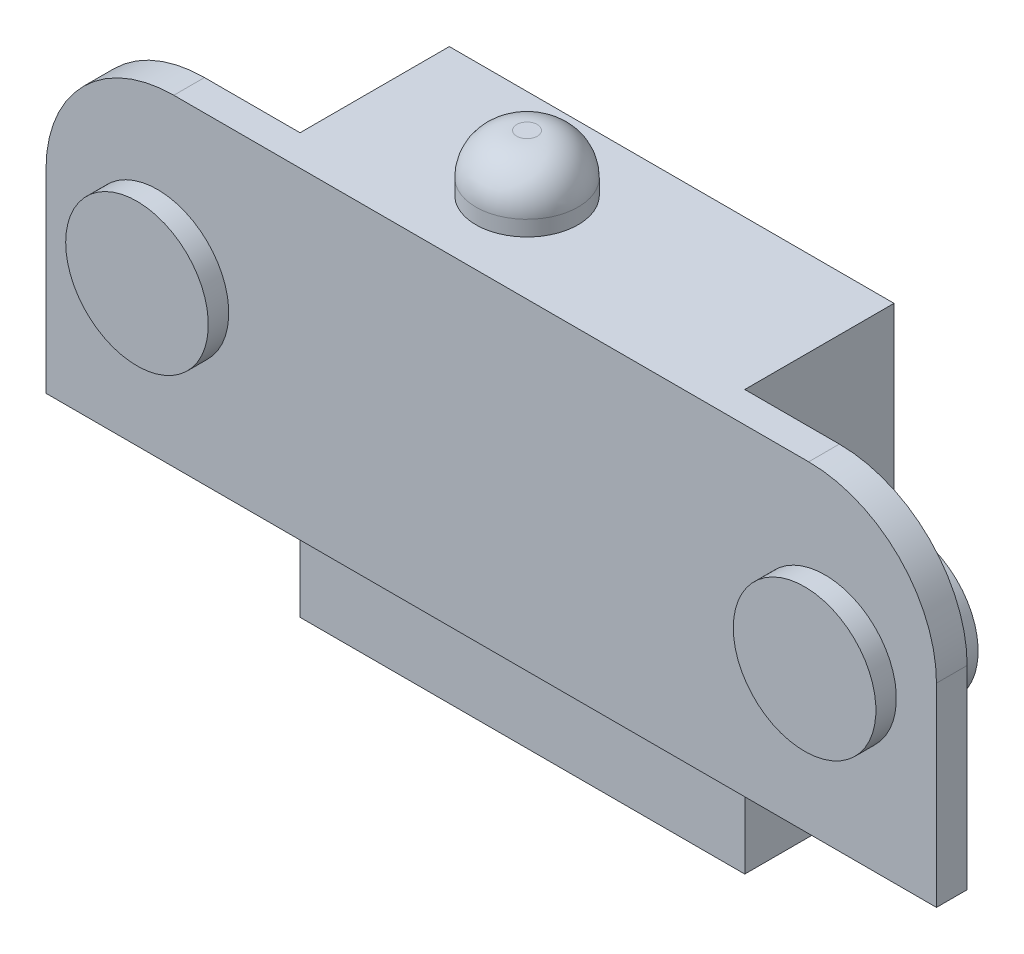
ISO-10303-21;
HEADER;
FILE_DESCRIPTION(('STEP AP214'),'2;1');
FILE_NAME('part.step','',(''),(''),'','','');
FILE_SCHEMA(('AUTOMOTIVE_DESIGN { 1 0 10303 214 1 1 1 1 }'));
ENDSEC;
DATA;
#1=APPLICATION_CONTEXT('core data for automotive mechanical design processes');
#2=APPLICATION_PROTOCOL_DEFINITION('international standard','automotive_design',2000,#1);
#3=PRODUCT_CONTEXT('',#1,'mechanical');
#4=PRODUCT('Part','Part','',(#3));
#5=PRODUCT_RELATED_PRODUCT_CATEGORY('part','',(#4));
#6=PRODUCT_DEFINITION_FORMATION('','',#4);
#7=PRODUCT_DEFINITION_CONTEXT('part definition',#1,'design');
#8=PRODUCT_DEFINITION('design','',#6,#7);
#9=PRODUCT_DEFINITION_SHAPE('','',#8);
#10=(LENGTH_UNIT() NAMED_UNIT(*) SI_UNIT(.MILLI.,.METRE.));
#11=(NAMED_UNIT(*) PLANE_ANGLE_UNIT() SI_UNIT($,.RADIAN.));
#12=(NAMED_UNIT(*) SI_UNIT($,.STERADIAN.) SOLID_ANGLE_UNIT());
#13=UNCERTAINTY_MEASURE_WITH_UNIT(LENGTH_MEASURE(1.E-05),#10,'distance_accuracy_value','');
#14=(GEOMETRIC_REPRESENTATION_CONTEXT(3) GLOBAL_UNCERTAINTY_ASSIGNED_CONTEXT((#13)) GLOBAL_UNIT_ASSIGNED_CONTEXT((#10,
#11,#12)) REPRESENTATION_CONTEXT('',''));
#15=CARTESIAN_POINT('',(0.,0.,0.));
#16=DIRECTION('',(0.,0.,1.));
#17=DIRECTION('',(1.,0.,0.));
#18=AXIS2_PLACEMENT_3D('',#15,#16,#17);
#19=CARTESIAN_POINT('',(19.431,18.796,-2.9464));
#20=DIRECTION('',(0.,1.,0.));
#21=DIRECTION('',(0.,0.,1.));
#22=AXIS2_PLACEMENT_3D('',#19,#20,#21);
#23=PLANE('',#22);
#24=CARTESIAN_POINT('',(19.431,18.796,-2.9464));
#25=DIRECTION('',(0.,-1.,0.));
#26=DIRECTION('',(0.,0.,-1.));
#27=AXIS2_PLACEMENT_3D('',#24,#25,#26);
#28=CIRCLE('',#27,0.508000000000002);
#29=CARTESIAN_POINT('',(19.431,18.796,-3.4544));
#30=VERTEX_POINT('',#29);
#31=EDGE_CURVE('E19',#30,#30,#28,.T.);
#32=ORIENTED_EDGE('',*,*,#31,.F.);
#33=EDGE_LOOP('',(#32));
#34=FACE_BOUND('',#33,.T.);
#35=ADVANCED_FACE('F16',(#34),#23,.T.);
#36=CARTESIAN_POINT('',(5.5372,8.001,-2.54));
#37=DIRECTION('',(0.,0.,1.));
#38=DIRECTION('',(1.,0.,0.));
#39=AXIS2_PLACEMENT_3D('',#36,#37,#38);
#40=PLANE('',#39);
#41=CARTESIAN_POINT('',(5.5372,8.001,-2.54));
#42=DIRECTION('',(0.,0.,-1.));
#43=DIRECTION('',(-1.,0.,0.));
#44=AXIS2_PLACEMENT_3D('',#41,#42,#43);
#45=CIRCLE('',#44,3.5433);
#46=CARTESIAN_POINT('',(1.9939,8.001,-2.54));
#47=VERTEX_POINT('',#46);
#48=EDGE_CURVE('E246',#47,#47,#45,.F.);
#49=ORIENTED_EDGE('',*,*,#48,.F.);
#50=EDGE_LOOP('',(#49));
#51=FACE_BOUND('',#50,.T.);
#52=ADVANCED_FACE('F256',(#51),#40,.F.);
#53=CARTESIAN_POINT('',(38.7096,8.001,-2.54));
#54=DIRECTION('',(0.,0.,1.));
#55=DIRECTION('',(1.,0.,0.));
#56=AXIS2_PLACEMENT_3D('',#53,#54,#55);
#57=PLANE('',#56);
#58=CARTESIAN_POINT('',(38.7096,8.001,-2.54));
#59=DIRECTION('',(0.,0.,-1.));
#60=DIRECTION('',(-1.,0.,0.));
#61=AXIS2_PLACEMENT_3D('',#58,#59,#60);
#62=CIRCLE('',#61,3.5433);
#63=CARTESIAN_POINT('',(35.1663,8.001,-2.54));
#64=VERTEX_POINT('',#63);
#65=EDGE_CURVE('E209',#64,#64,#62,.F.);
#66=ORIENTED_EDGE('',*,*,#65,.F.);
#67=EDGE_LOOP('',(#66));
#68=FACE_BOUND('',#67,.T.);
#69=ADVANCED_FACE('F261',(#68),#57,.F.);
#70=CARTESIAN_POINT('',(19.431,16.764,-2.9464));
#71=DIRECTION('',(0.,-1.,0.));
#72=DIRECTION('',(1.,0.,0.));
#73=AXIS2_PLACEMENT_3D('',#70,#71,#72);
#74=DEGENERATE_TOROIDAL_SURFACE('',#73,0.508,2.032,.T.);
#75=CARTESIAN_POINT('',(19.431,16.764,-2.9464));
#76=DIRECTION('',(0.,1.,0.));
#77=DIRECTION('',(0.,0.,1.));
#78=AXIS2_PLACEMENT_3D('',#75,#76,#77);
#79=CIRCLE('',#78,2.54);
#80=CARTESIAN_POINT('',(19.431,16.764,-0.4064));
#81=VERTEX_POINT('',#80);
#82=EDGE_CURVE('E206',#81,#81,#79,.F.);
#83=ORIENTED_EDGE('',*,*,#82,.F.);
#84=EDGE_LOOP('',(#83));
#85=FACE_BOUND('',#84,.T.);
#86=ORIENTED_EDGE('',*,*,#31,.T.);
#87=EDGE_LOOP('',(#86));
#88=FACE_BOUND('',#87,.T.);
#89=ADVANCED_FACE('F253',(#85,#88),#74,.T.);
#90=CARTESIAN_POINT('',(5.5372,8.001,2.54));
#91=DIRECTION('',(0.,0.,-1.));
#92=DIRECTION('',(-1.,0.,0.));
#93=AXIS2_PLACEMENT_3D('',#90,#91,#92);
#94=CYLINDRICAL_SURFACE('',#93,3.5433);
#95=ORIENTED_EDGE('',*,*,#48,.T.);
#96=EDGE_LOOP('',(#95));
#97=FACE_BOUND('',#96,.T.);
#98=CARTESIAN_POINT('',(5.5372,8.001,0.));
#99=DIRECTION('',(0.,0.,-1.));
#100=DIRECTION('',(-1.,0.,0.));
#101=AXIS2_PLACEMENT_3D('',#98,#99,#100);
#102=CIRCLE('',#101,3.5433);
#103=CARTESIAN_POINT('',(1.9939,8.001,0.));
#104=VERTEX_POINT('',#103);
#105=EDGE_CURVE('E154',#104,#104,#102,.T.);
#106=ORIENTED_EDGE('',*,*,#105,.T.);
#107=EDGE_LOOP('',(#106));
#108=FACE_BOUND('',#107,.T.);
#109=ADVANCED_FACE('F340',(#97,#108),#94,.T.);
#110=CARTESIAN_POINT('',(11.0998,-4.8514,0.));
#111=DIRECTION('',(0.,-1.,0.));
#112=DIRECTION('',(0.,0.,-1.));
#113=AXIS2_PLACEMENT_3D('',#110,#111,#112);
#114=PLANE('',#113);
#115=DIRECTION('',(1.,0.,0.));
#116=VECTOR('',#115,1.);
#117=CARTESIAN_POINT('',(22.1488,-4.8514,0.));
#118=LINE('',#117,#116);
#119=CARTESIAN_POINT('',(11.0998,-4.8514,0.));
#120=VERTEX_POINT('',#119);
#121=CARTESIAN_POINT('',(33.1978,-4.8514,0.));
#122=VERTEX_POINT('',#121);
#123=EDGE_CURVE('E148',#120,#122,#118,.T.);
#124=ORIENTED_EDGE('',*,*,#123,.F.);
#125=DIRECTION('',(0.,0.,1.));
#126=VECTOR('',#125,1.);
#127=CARTESIAN_POINT('',(11.0998,-4.8514,0.));
#128=LINE('',#127,#126);
#129=CARTESIAN_POINT('',(11.0998,-4.8514,-7.4168));
#130=VERTEX_POINT('',#129);
#131=EDGE_CURVE('E164',#130,#120,#128,.T.);
#132=ORIENTED_EDGE('',*,*,#131,.F.);
#133=DIRECTION('',(1.,0.,0.));
#134=VECTOR('',#133,1.);
#135=CARTESIAN_POINT('',(22.1488,-4.8514,-7.4168));
#136=LINE('',#135,#134);
#137=CARTESIAN_POINT('',(33.1978,-4.8514,-7.4168));
#138=VERTEX_POINT('',#137);
#139=EDGE_CURVE('E186',#130,#138,#136,.T.);
#140=ORIENTED_EDGE('',*,*,#139,.T.);
#141=DIRECTION('',(0.,0.,-1.));
#142=VECTOR('',#141,1.);
#143=CARTESIAN_POINT('',(33.1978,-4.8514,0.));
#144=LINE('',#143,#142);
#145=EDGE_CURVE('E196',#122,#138,#144,.T.);
#146=ORIENTED_EDGE('',*,*,#145,.F.);
#147=EDGE_LOOP('',(#124,#132,#140,#146));
#148=FACE_BOUND('',#147,.T.);
#149=ADVANCED_FACE('F336',(#148),#114,.T.);
#150=CARTESIAN_POINT('',(38.7096,8.001,2.54));
#151=DIRECTION('',(0.,0.,-1.));
#152=DIRECTION('',(-1.,0.,0.));
#153=AXIS2_PLACEMENT_3D('',#150,#151,#152);
#154=CYLINDRICAL_SURFACE('',#153,3.5433);
#155=ORIENTED_EDGE('',*,*,#65,.T.);
#156=EDGE_LOOP('',(#155));
#157=FACE_BOUND('',#156,.T.);
#158=CARTESIAN_POINT('',(38.7096,8.001,0.));
#159=DIRECTION('',(0.,0.,-1.));
#160=DIRECTION('',(-1.,0.,0.));
#161=AXIS2_PLACEMENT_3D('',#158,#159,#160);
#162=CIRCLE('',#161,3.5433);
#163=CARTESIAN_POINT('',(35.1663,8.001,0.));
#164=VERTEX_POINT('',#163);
#165=EDGE_CURVE('E108',#164,#164,#162,.T.);
#166=ORIENTED_EDGE('',*,*,#165,.T.);
#167=EDGE_LOOP('',(#166));
#168=FACE_BOUND('',#167,.T.);
#169=ADVANCED_FACE('F332',(#157,#168),#154,.T.);
#170=CARTESIAN_POINT('',(19.431,16.002,-2.9464));
#171=DIRECTION('',(0.,1.,0.));
#172=DIRECTION('',(0.,0.,1.));
#173=AXIS2_PLACEMENT_3D('',#170,#171,#172);
#174=CYLINDRICAL_SURFACE('',#173,2.54);
#175=ORIENTED_EDGE('',*,*,#82,.T.);
#176=EDGE_LOOP('',(#175));
#177=FACE_BOUND('',#176,.T.);
#178=CARTESIAN_POINT('',(19.431,16.002,-2.9464));
#179=DIRECTION('',(0.,1.,0.));
#180=DIRECTION('',(0.,0.,1.));
#181=AXIS2_PLACEMENT_3D('',#178,#179,#180);
#182=CIRCLE('',#181,2.54);
#183=CARTESIAN_POINT('',(19.431,16.002,-0.4064));
#184=VERTEX_POINT('',#183);
#185=EDGE_CURVE('E107',#184,#184,#182,.F.);
#186=ORIENTED_EDGE('',*,*,#185,.F.);
#187=EDGE_LOOP('',(#186));
#188=FACE_BOUND('',#187,.T.);
#189=ADVANCED_FACE('F328',(#177,#188),#174,.T.);
#190=CARTESIAN_POINT('',(33.1978,-4.8514,0.));
#191=DIRECTION('',(1.,0.,0.));
#192=DIRECTION('',(0.,0.,-1.));
#193=AXIS2_PLACEMENT_3D('',#190,#191,#192);
#194=PLANE('',#193);
#195=DIRECTION('',(0.,1.,0.));
#196=VECTOR('',#195,1.);
#197=CARTESIAN_POINT('',(33.1978,5.5753,0.));
#198=LINE('',#197,#196);
#199=CARTESIAN_POINT('',(33.1978,0.,0.));
#200=VERTEX_POINT('',#199);
#201=EDGE_CURVE('E138',#122,#200,#198,.T.);
#202=ORIENTED_EDGE('',*,*,#201,.F.);
#203=ORIENTED_EDGE('',*,*,#145,.T.);
#204=DIRECTION('',(0.,1.,0.));
#205=VECTOR('',#204,1.);
#206=CARTESIAN_POINT('',(33.1978,5.5753,-7.4168));
#207=LINE('',#206,#205);
#208=CARTESIAN_POINT('',(33.1978,16.002,-7.4168));
#209=VERTEX_POINT('',#208);
#210=EDGE_CURVE('E194',#138,#209,#207,.T.);
#211=ORIENTED_EDGE('',*,*,#210,.T.);
#212=DIRECTION('',(0.,0.,1.));
#213=VECTOR('',#212,1.);
#214=CARTESIAN_POINT('',(33.1978,16.002,0.));
#215=LINE('',#214,#213);
#216=CARTESIAN_POINT('',(33.1978,16.002,0.));
#217=VERTEX_POINT('',#216);
#218=EDGE_CURVE('E191',#217,#209,#215,.F.);
#219=ORIENTED_EDGE('',*,*,#218,.F.);
#220=DIRECTION('',(0.,1.,0.));
#221=VECTOR('',#220,1.);
#222=CARTESIAN_POINT('',(33.1978,8.001,0.));
#223=LINE('',#222,#221);
#224=EDGE_CURVE('E136',#217,#200,#223,.F.);
#225=ORIENTED_EDGE('',*,*,#224,.T.);
#226=EDGE_LOOP('',(#202,#203,#211,#219,#225));
#227=FACE_BOUND('',#226,.T.);
#228=ADVANCED_FACE('F324',(#227),#194,.T.);
#229=CARTESIAN_POINT('',(22.1488,5.5753,-7.4168));
#230=DIRECTION('',(0.,0.,1.));
#231=DIRECTION('',(1.,0.,0.));
#232=AXIS2_PLACEMENT_3D('',#229,#230,#231);
#233=PLANE('',#232);
#234=DIRECTION('',(0.,1.,0.));
#235=VECTOR('',#234,1.);
#236=CARTESIAN_POINT('',(11.0998,16.002,-7.4168));
#237=LINE('',#236,#235);
#238=CARTESIAN_POINT('',(11.0998,16.002,-7.4168));
#239=VERTEX_POINT('',#238);
#240=EDGE_CURVE('E183',#239,#130,#237,.F.);
#241=ORIENTED_EDGE('',*,*,#240,.F.);
#242=DIRECTION('',(1.,0.,0.));
#243=VECTOR('',#242,1.);
#244=CARTESIAN_POINT('',(0.,16.002,-7.4168));
#245=LINE('',#244,#243);
#246=EDGE_CURVE('E180',#209,#239,#245,.F.);
#247=ORIENTED_EDGE('',*,*,#246,.F.);
#248=ORIENTED_EDGE('',*,*,#210,.F.);
#249=ORIENTED_EDGE('',*,*,#139,.F.);
#250=EDGE_LOOP('',(#241,#247,#248,#249));
#251=FACE_BOUND('',#250,.T.);
#252=ADVANCED_FACE('F320',(#251),#233,.F.);
#253=CARTESIAN_POINT('',(11.0998,16.002,0.));
#254=DIRECTION('',(-1.,0.,0.));
#255=DIRECTION('',(0.,0.,1.));
#256=AXIS2_PLACEMENT_3D('',#253,#254,#255);
#257=PLANE('',#256);
#258=DIRECTION('',(0.,1.,0.));
#259=VECTOR('',#258,1.);
#260=CARTESIAN_POINT('',(11.0998,8.001,0.));
#261=LINE('',#260,#259);
#262=CARTESIAN_POINT('',(11.0998,0.,0.));
#263=VERTEX_POINT('',#262);
#264=CARTESIAN_POINT('',(11.0998,16.002,0.));
#265=VERTEX_POINT('',#264);
#266=EDGE_CURVE('E162',#263,#265,#261,.T.);
#267=ORIENTED_EDGE('',*,*,#266,.T.);
#268=DIRECTION('',(0.,0.,1.));
#269=VECTOR('',#268,1.);
#270=CARTESIAN_POINT('',(11.0998,16.002,0.));
#271=LINE('',#270,#269);
#272=EDGE_CURVE('E175',#239,#265,#271,.T.);
#273=ORIENTED_EDGE('',*,*,#272,.F.);
#274=ORIENTED_EDGE('',*,*,#240,.T.);
#275=ORIENTED_EDGE('',*,*,#131,.T.);
#276=DIRECTION('',(0.,1.,0.));
#277=VECTOR('',#276,1.);
#278=CARTESIAN_POINT('',(11.0998,5.5753,0.));
#279=LINE('',#278,#277);
#280=EDGE_CURVE('E151',#263,#120,#279,.F.);
#281=ORIENTED_EDGE('',*,*,#280,.F.);
#282=EDGE_LOOP('',(#267,#273,#274,#275,#281));
#283=FACE_BOUND('',#282,.T.);
#284=ADVANCED_FACE('F316',(#283),#257,.T.);
#285=CARTESIAN_POINT('',(22.1234,8.001,0.));
#286=DIRECTION('',(0.,0.,1.));
#287=DIRECTION('',(1.,0.,0.));
#288=AXIS2_PLACEMENT_3D('',#285,#286,#287);
#289=PLANE('',#288);
#290=ORIENTED_EDGE('',*,*,#105,.F.);
#291=EDGE_LOOP('',(#290));
#292=FACE_BOUND('',#291,.T.);
#293=DIRECTION('',(1.,0.,0.));
#294=VECTOR('',#293,1.);
#295=CARTESIAN_POINT('',(0.,16.002,0.));
#296=LINE('',#295,#294);
#297=CARTESIAN_POINT('',(6.35,16.002,0.));
#298=VERTEX_POINT('',#297);
#299=EDGE_CURVE('E172',#265,#298,#296,.F.);
#300=ORIENTED_EDGE('',*,*,#299,.F.);
#301=ORIENTED_EDGE('',*,*,#266,.F.);
#302=DIRECTION('',(1.,0.,0.));
#303=VECTOR('',#302,1.);
#304=CARTESIAN_POINT('',(44.2468,0.,0.));
#305=LINE('',#304,#303);
#306=CARTESIAN_POINT('',(0.,0.,0.));
#307=VERTEX_POINT('',#306);
#308=EDGE_CURVE('E143',#307,#263,#305,.T.);
#309=ORIENTED_EDGE('',*,*,#308,.F.);
#310=DIRECTION('',(0.,1.,0.));
#311=VECTOR('',#310,1.);
#312=CARTESIAN_POINT('',(0.,0.,0.));
#313=LINE('',#312,#311);
#314=CARTESIAN_POINT('',(0.,9.652,0.));
#315=VERTEX_POINT('',#314);
#316=EDGE_CURVE('E167',#315,#307,#313,.F.);
#317=ORIENTED_EDGE('',*,*,#316,.F.);
#318=CARTESIAN_POINT('',(6.35,9.652,0.));
#319=DIRECTION('',(0.,0.,1.));
#320=DIRECTION('',(1.,0.,0.));
#321=AXIS2_PLACEMENT_3D('',#318,#319,#320);
#322=CIRCLE('',#321,6.35);
#323=EDGE_CURVE('E237',#298,#315,#322,.T.);
#324=ORIENTED_EDGE('',*,*,#323,.F.);
#325=EDGE_LOOP('',(#300,#301,#309,#317,#324));
#326=FACE_BOUND('',#325,.T.);
#327=ADVANCED_FACE('F312',(#292,#326),#289,.F.);
#328=CARTESIAN_POINT('',(22.1488,5.5753,0.));
#329=DIRECTION('',(0.,0.,1.));
#330=DIRECTION('',(1.,0.,0.));
#331=AXIS2_PLACEMENT_3D('',#328,#329,#330);
#332=PLANE('',#331);
#333=ORIENTED_EDGE('',*,*,#123,.T.);
#334=ORIENTED_EDGE('',*,*,#201,.T.);
#335=DIRECTION('',(1.,0.,0.));
#336=VECTOR('',#335,1.);
#337=CARTESIAN_POINT('',(44.2468,0.,0.));
#338=LINE('',#337,#336);
#339=EDGE_CURVE('E133',#263,#200,#338,.T.);
#340=ORIENTED_EDGE('',*,*,#339,.F.);
#341=ORIENTED_EDGE('',*,*,#280,.T.);
#342=EDGE_LOOP('',(#333,#334,#340,#341));
#343=FACE_BOUND('',#342,.T.);
#344=ADVANCED_FACE('F308',(#343),#332,.T.);
#345=CARTESIAN_POINT('',(22.1234,8.001,0.));
#346=DIRECTION('',(0.,0.,1.));
#347=DIRECTION('',(1.,0.,0.));
#348=AXIS2_PLACEMENT_3D('',#345,#346,#347);
#349=PLANE('',#348);
#350=ORIENTED_EDGE('',*,*,#165,.F.);
#351=EDGE_LOOP('',(#350));
#352=FACE_BOUND('',#351,.T.);
#353=DIRECTION('',(0.,1.,0.));
#354=VECTOR('',#353,1.);
#355=CARTESIAN_POINT('',(44.2468,16.002,0.));
#356=LINE('',#355,#354);
#357=CARTESIAN_POINT('',(44.2468,0.,0.));
#358=VERTEX_POINT('',#357);
#359=CARTESIAN_POINT('',(44.2468,9.652,0.));
#360=VERTEX_POINT('',#359);
#361=EDGE_CURVE('E102',#358,#360,#356,.T.);
#362=ORIENTED_EDGE('',*,*,#361,.F.);
#363=DIRECTION('',(1.,0.,0.));
#364=VECTOR('',#363,1.);
#365=CARTESIAN_POINT('',(44.2468,0.,0.));
#366=LINE('',#365,#364);
#367=EDGE_CURVE('E117',#200,#358,#366,.T.);
#368=ORIENTED_EDGE('',*,*,#367,.F.);
#369=ORIENTED_EDGE('',*,*,#224,.F.);
#370=DIRECTION('',(1.,0.,0.));
#371=VECTOR('',#370,1.);
#372=CARTESIAN_POINT('',(0.,16.002,0.));
#373=LINE('',#372,#371);
#374=CARTESIAN_POINT('',(37.8968,16.002,0.));
#375=VERTEX_POINT('',#374);
#376=EDGE_CURVE('E104',#375,#217,#373,.F.);
#377=ORIENTED_EDGE('',*,*,#376,.F.);
#378=CARTESIAN_POINT('',(37.8968,9.652,0.));
#379=DIRECTION('',(0.,0.,1.));
#380=DIRECTION('',(1.,0.,0.));
#381=AXIS2_PLACEMENT_3D('',#378,#379,#380);
#382=CIRCLE('',#381,6.35);
#383=EDGE_CURVE('E97',#360,#375,#382,.T.);
#384=ORIENTED_EDGE('',*,*,#383,.F.);
#385=EDGE_LOOP('',(#362,#368,#369,#377,#384));
#386=FACE_BOUND('',#385,.T.);
#387=ADVANCED_FACE('F99',(#352,#386),#349,.F.);
#388=CARTESIAN_POINT('',(38.7096,8.001,2.54));
#389=DIRECTION('',(0.,0.,1.));
#390=DIRECTION('',(1.,0.,0.));
#391=AXIS2_PLACEMENT_3D('',#388,#389,#390);
#392=PLANE('',#391);
#393=CARTESIAN_POINT('',(38.7096,8.001,2.54));
#394=DIRECTION('',(0.,0.,-1.));
#395=DIRECTION('',(-1.,0.,0.));
#396=AXIS2_PLACEMENT_3D('',#393,#394,#395);
#397=CIRCLE('',#396,3.5433);
#398=CARTESIAN_POINT('',(35.1663,8.001,2.54));
#399=VERTEX_POINT('',#398);
#400=EDGE_CURVE('E120',#399,#399,#397,.T.);
#401=ORIENTED_EDGE('',*,*,#400,.F.);
#402=EDGE_LOOP('',(#401));
#403=FACE_BOUND('',#402,.T.);
#404=ADVANCED_FACE('F301',(#403),#392,.T.);
#405=CARTESIAN_POINT('',(5.5372,8.001,2.54));
#406=DIRECTION('',(0.,0.,1.));
#407=DIRECTION('',(1.,0.,0.));
#408=AXIS2_PLACEMENT_3D('',#405,#406,#407);
#409=PLANE('',#408);
#410=CARTESIAN_POINT('',(5.5372,8.001,2.54));
#411=DIRECTION('',(0.,0.,-1.));
#412=DIRECTION('',(-1.,0.,0.));
#413=AXIS2_PLACEMENT_3D('',#410,#411,#412);
#414=CIRCLE('',#413,3.5433);
#415=CARTESIAN_POINT('',(1.9939,8.001,2.54));
#416=VERTEX_POINT('',#415);
#417=EDGE_CURVE('E123',#416,#416,#414,.T.);
#418=ORIENTED_EDGE('',*,*,#417,.F.);
#419=EDGE_LOOP('',(#418));
#420=FACE_BOUND('',#419,.T.);
#421=ADVANCED_FACE('F298',(#420),#409,.T.);
#422=CARTESIAN_POINT('',(37.8968,9.652,0.));
#423=DIRECTION('',(0.,0.,1.));
#424=DIRECTION('',(1.,0.,0.));
#425=AXIS2_PLACEMENT_3D('',#422,#423,#424);
#426=CYLINDRICAL_SURFACE('',#425,6.35);
#427=ORIENTED_EDGE('',*,*,#383,.T.);
#428=DIRECTION('',(0.,0.,1.));
#429=VECTOR('',#428,1.);
#430=CARTESIAN_POINT('',(37.8968,16.002,0.));
#431=LINE('',#430,#429);
#432=CARTESIAN_POINT('',(37.8968,16.002,1.524));
#433=VERTEX_POINT('',#432);
#434=EDGE_CURVE('E128',#433,#375,#431,.F.);
#435=ORIENTED_EDGE('',*,*,#434,.F.);
#436=CARTESIAN_POINT('',(37.8968,9.652,1.524));
#437=DIRECTION('',(0.,0.,1.));
#438=DIRECTION('',(1.,0.,0.));
#439=AXIS2_PLACEMENT_3D('',#436,#437,#438);
#440=CIRCLE('',#439,6.35);
#441=CARTESIAN_POINT('',(44.2468,9.652,1.524));
#442=VERTEX_POINT('',#441);
#443=EDGE_CURVE('E114',#442,#433,#440,.T.);
#444=ORIENTED_EDGE('',*,*,#443,.F.);
#445=DIRECTION('',(0.,0.,-1.));
#446=VECTOR('',#445,1.);
#447=CARTESIAN_POINT('',(44.2468,9.652,0.));
#448=LINE('',#447,#446);
#449=EDGE_CURVE('E111',#360,#442,#448,.F.);
#450=ORIENTED_EDGE('',*,*,#449,.F.);
#451=EDGE_LOOP('',(#427,#435,#444,#450));
#452=FACE_BOUND('',#451,.T.);
#453=ADVANCED_FACE('F112',(#452),#426,.T.);
#454=CARTESIAN_POINT('',(0.,16.002,0.));
#455=DIRECTION('',(0.,1.,0.));
#456=DIRECTION('',(0.,0.,1.));
#457=AXIS2_PLACEMENT_3D('',#454,#455,#456);
#458=PLANE('',#457);
#459=DIRECTION('',(0.,0.,1.));
#460=VECTOR('',#459,1.);
#461=CARTESIAN_POINT('',(6.35,16.002,0.));
#462=LINE('',#461,#460);
#463=CARTESIAN_POINT('',(6.35,16.002,1.524));
#464=VERTEX_POINT('',#463);
#465=EDGE_CURVE('E174',#464,#298,#462,.F.);
#466=ORIENTED_EDGE('',*,*,#465,.F.);
#467=DIRECTION('',(1.,0.,0.));
#468=VECTOR('',#467,1.);
#469=CARTESIAN_POINT('',(22.1234,16.002,1.524));
#470=LINE('',#469,#468);
#471=EDGE_CURVE('E233',#433,#464,#470,.F.);
#472=ORIENTED_EDGE('',*,*,#471,.F.);
#473=ORIENTED_EDGE('',*,*,#434,.T.);
#474=ORIENTED_EDGE('',*,*,#376,.T.);
#475=ORIENTED_EDGE('',*,*,#218,.T.);
#476=ORIENTED_EDGE('',*,*,#246,.T.);
#477=ORIENTED_EDGE('',*,*,#272,.T.);
#478=ORIENTED_EDGE('',*,*,#299,.T.);
#479=EDGE_LOOP('',(#466,#472,#473,#474,#475,#476,#477,#478));
#480=FACE_BOUND('',#479,.T.);
#481=ORIENTED_EDGE('',*,*,#185,.T.);
#482=EDGE_LOOP('',(#481));
#483=FACE_BOUND('',#482,.T.);
#484=ADVANCED_FACE('F291',(#480,#483),#458,.T.);
#485=CARTESIAN_POINT('',(6.35,9.652,0.));
#486=DIRECTION('',(0.,0.,1.));
#487=DIRECTION('',(1.,0.,0.));
#488=AXIS2_PLACEMENT_3D('',#485,#486,#487);
#489=CYLINDRICAL_SURFACE('',#488,6.35);
#490=ORIENTED_EDGE('',*,*,#323,.T.);
#491=DIRECTION('',(0.,0.,1.));
#492=VECTOR('',#491,1.);
#493=CARTESIAN_POINT('',(0.,9.652,0.));
#494=LINE('',#493,#492);
#495=CARTESIAN_POINT('',(0.,9.652,1.524));
#496=VERTEX_POINT('',#495);
#497=EDGE_CURVE('E169',#496,#315,#494,.F.);
#498=ORIENTED_EDGE('',*,*,#497,.F.);
#499=CARTESIAN_POINT('',(6.35,9.652,1.524));
#500=DIRECTION('',(0.,0.,1.));
#501=DIRECTION('',(1.,0.,0.));
#502=AXIS2_PLACEMENT_3D('',#499,#500,#501);
#503=CIRCLE('',#502,6.35);
#504=EDGE_CURVE('E229',#464,#496,#503,.T.);
#505=ORIENTED_EDGE('',*,*,#504,.F.);
#506=ORIENTED_EDGE('',*,*,#465,.T.);
#507=EDGE_LOOP('',(#490,#498,#505,#506));
#508=FACE_BOUND('',#507,.T.);
#509=ADVANCED_FACE('F287',(#508),#489,.T.);
#510=CARTESIAN_POINT('',(0.,0.,0.));
#511=DIRECTION('',(-1.,0.,0.));
#512=DIRECTION('',(0.,0.,1.));
#513=AXIS2_PLACEMENT_3D('',#510,#511,#512);
#514=PLANE('',#513);
#515=DIRECTION('',(0.,0.,-1.));
#516=VECTOR('',#515,1.);
#517=CARTESIAN_POINT('',(0.,0.,0.));
#518=LINE('',#517,#516);
#519=CARTESIAN_POINT('',(0.,0.,1.524));
#520=VERTEX_POINT('',#519);
#521=EDGE_CURVE('E159',#520,#307,#518,.T.);
#522=ORIENTED_EDGE('',*,*,#521,.F.);
#523=DIRECTION('',(0.,1.,0.));
#524=VECTOR('',#523,1.);
#525=CARTESIAN_POINT('',(0.,8.001,1.524));
#526=LINE('',#525,#524);
#527=EDGE_CURVE('E232',#496,#520,#526,.F.);
#528=ORIENTED_EDGE('',*,*,#527,.F.);
#529=ORIENTED_EDGE('',*,*,#497,.T.);
#530=ORIENTED_EDGE('',*,*,#316,.T.);
#531=EDGE_LOOP('',(#522,#528,#529,#530));
#532=FACE_BOUND('',#531,.T.);
#533=ADVANCED_FACE('F284',(#532),#514,.T.);
#534=CARTESIAN_POINT('',(44.2468,0.,0.));
#535=DIRECTION('',(0.,-1.,0.));
#536=DIRECTION('',(0.,0.,-1.));
#537=AXIS2_PLACEMENT_3D('',#534,#535,#536);
#538=PLANE('',#537);
#539=ORIENTED_EDGE('',*,*,#367,.T.);
#540=DIRECTION('',(0.,0.,-1.));
#541=VECTOR('',#540,1.);
#542=CARTESIAN_POINT('',(44.2468,0.,0.));
#543=LINE('',#542,#541);
#544=CARTESIAN_POINT('',(44.2468,0.,1.524));
#545=VERTEX_POINT('',#544);
#546=EDGE_CURVE('E34',#545,#358,#543,.T.);
#547=ORIENTED_EDGE('',*,*,#546,.F.);
#548=DIRECTION('',(1.,0.,0.));
#549=VECTOR('',#548,1.);
#550=CARTESIAN_POINT('',(22.1234,0.,1.524));
#551=LINE('',#550,#549);
#552=EDGE_CURVE('E538',#520,#545,#551,.T.);
#553=ORIENTED_EDGE('',*,*,#552,.F.);
#554=ORIENTED_EDGE('',*,*,#521,.T.);
#555=ORIENTED_EDGE('',*,*,#308,.T.);
#556=ORIENTED_EDGE('',*,*,#339,.T.);
#557=EDGE_LOOP('',(#539,#547,#553,#554,#555,#556));
#558=FACE_BOUND('',#557,.T.);
#559=ADVANCED_FACE('F281',(#558),#538,.T.);
#560=CARTESIAN_POINT('',(44.2468,16.002,0.));
#561=DIRECTION('',(1.,0.,0.));
#562=DIRECTION('',(0.,0.,-1.));
#563=AXIS2_PLACEMENT_3D('',#560,#561,#562);
#564=PLANE('',#563);
#565=ORIENTED_EDGE('',*,*,#546,.T.);
#566=ORIENTED_EDGE('',*,*,#361,.T.);
#567=ORIENTED_EDGE('',*,*,#449,.T.);
#568=DIRECTION('',(0.,1.,0.));
#569=VECTOR('',#568,1.);
#570=CARTESIAN_POINT('',(44.2468,8.001,1.524));
#571=LINE('',#570,#569);
#572=EDGE_CURVE('E228',#545,#442,#571,.T.);
#573=ORIENTED_EDGE('',*,*,#572,.F.);
#574=EDGE_LOOP('',(#565,#566,#567,#573));
#575=FACE_BOUND('',#574,.T.);
#576=ADVANCED_FACE('F119',(#575),#564,.T.);
#577=CARTESIAN_POINT('',(38.7096,8.001,2.54));
#578=DIRECTION('',(0.,0.,-1.));
#579=DIRECTION('',(-1.,0.,0.));
#580=AXIS2_PLACEMENT_3D('',#577,#578,#579);
#581=CYLINDRICAL_SURFACE('',#580,3.5433);
#582=CARTESIAN_POINT('',(38.7096,8.001,1.524));
#583=DIRECTION('',(0.,0.,-1.));
#584=DIRECTION('',(-1.,0.,0.));
#585=AXIS2_PLACEMENT_3D('',#582,#583,#584);
#586=CIRCLE('',#585,3.5433);
#587=CARTESIAN_POINT('',(35.1663,8.001,1.524));
#588=VERTEX_POINT('',#587);
#589=EDGE_CURVE('E25',#588,#588,#586,.T.);
#590=ORIENTED_EDGE('',*,*,#589,.F.);
#591=EDGE_LOOP('',(#590));
#592=FACE_BOUND('',#591,.T.);
#593=ORIENTED_EDGE('',*,*,#400,.T.);
#594=EDGE_LOOP('',(#593));
#595=FACE_BOUND('',#594,.T.);
#596=ADVANCED_FACE('F271',(#592,#595),#581,.T.);
#597=CARTESIAN_POINT('',(5.5372,8.001,2.54));
#598=DIRECTION('',(0.,0.,-1.));
#599=DIRECTION('',(-1.,0.,0.));
#600=AXIS2_PLACEMENT_3D('',#597,#598,#599);
#601=CYLINDRICAL_SURFACE('',#600,3.5433);
#602=CARTESIAN_POINT('',(5.5372,8.001,1.524));
#603=DIRECTION('',(0.,0.,-1.));
#604=DIRECTION('',(-1.,0.,0.));
#605=AXIS2_PLACEMENT_3D('',#602,#603,#604);
#606=CIRCLE('',#605,3.5433);
#607=CARTESIAN_POINT('',(1.9939,8.001,1.524));
#608=VERTEX_POINT('',#607);
#609=EDGE_CURVE('E11',#608,#608,#606,.T.);
#610=ORIENTED_EDGE('',*,*,#609,.F.);
#611=EDGE_LOOP('',(#610));
#612=FACE_BOUND('',#611,.T.);
#613=ORIENTED_EDGE('',*,*,#417,.T.);
#614=EDGE_LOOP('',(#613));
#615=FACE_BOUND('',#614,.T.);
#616=ADVANCED_FACE('F265',(#612,#615),#601,.T.);
#617=CARTESIAN_POINT('',(22.1234,8.001,1.524));
#618=DIRECTION('',(0.,0.,1.));
#619=DIRECTION('',(1.,0.,0.));
#620=AXIS2_PLACEMENT_3D('',#617,#618,#619);
#621=PLANE('',#620);
#622=ORIENTED_EDGE('',*,*,#609,.T.);
#623=EDGE_LOOP('',(#622));
#624=FACE_BOUND('',#623,.T.);
#625=ORIENTED_EDGE('',*,*,#589,.T.);
#626=EDGE_LOOP('',(#625));
#627=FACE_BOUND('',#626,.T.);
#628=ORIENTED_EDGE('',*,*,#552,.T.);
#629=ORIENTED_EDGE('',*,*,#572,.T.);
#630=ORIENTED_EDGE('',*,*,#443,.T.);
#631=ORIENTED_EDGE('',*,*,#471,.T.);
#632=ORIENTED_EDGE('',*,*,#504,.T.);
#633=ORIENTED_EDGE('',*,*,#527,.T.);
#634=EDGE_LOOP('',(#628,#629,#630,#631,#632,#633));
#635=FACE_BOUND('',#634,.T.);
#636=ADVANCED_FACE('F263',(#624,#627,#635),#621,.T.);
#637=CLOSED_SHELL('',(#35,#52,#69,#89,#109,#149,#169,#189,#228,#252,#284,#327,#344,#387,#404,
#421,#453,#484,#509,#533,#559,#576,#596,#616,#636));
#638=MANIFOLD_SOLID_BREP('B1',#637);
#639=ADVANCED_BREP_SHAPE_REPRESENTATION('',(#18,#638),#14);
#640=SHAPE_DEFINITION_REPRESENTATION(#9,#639);
ENDSEC;
END-ISO-10303-21;
